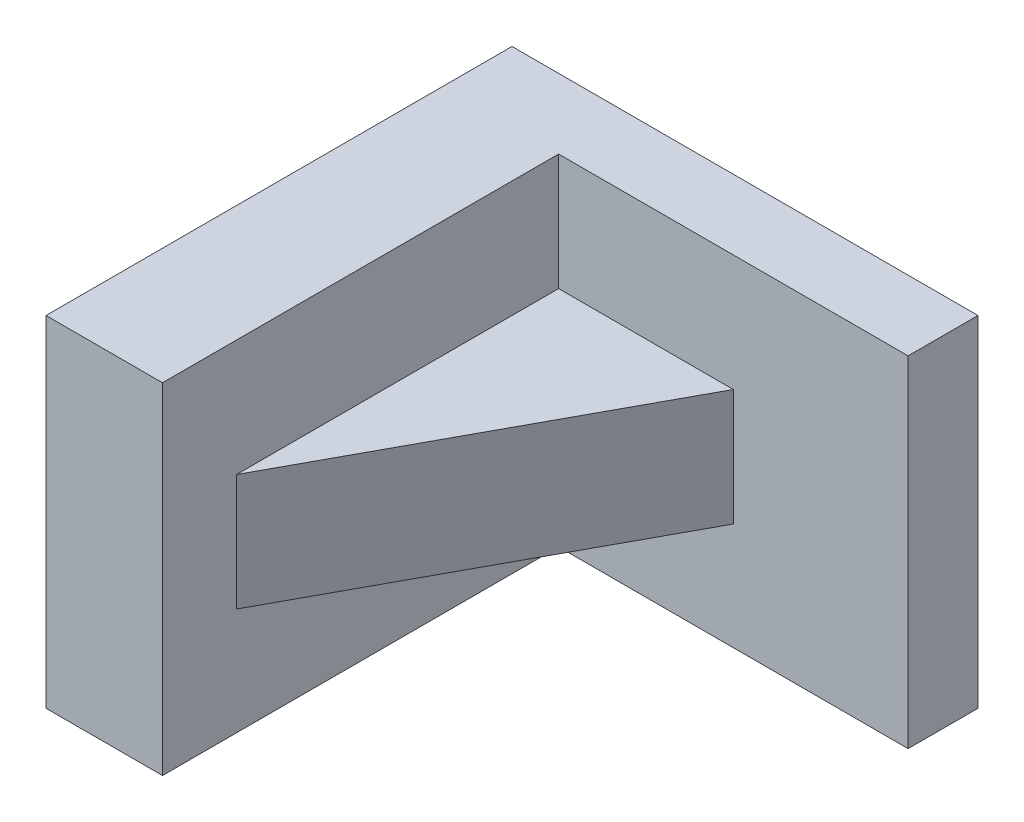
ISO-10303-21;
HEADER;
FILE_DESCRIPTION(('STEP AP214'),'2;1');
FILE_NAME('part.step','',(''),(''),'','','');
FILE_SCHEMA(('AUTOMOTIVE_DESIGN { 1 0 10303 214 1 1 1 1 }'));
ENDSEC;
DATA;
#1=APPLICATION_CONTEXT('core data for automotive mechanical design processes');
#2=APPLICATION_PROTOCOL_DEFINITION('international standard','automotive_design',2000,#1);
#3=PRODUCT_CONTEXT('',#1,'mechanical');
#4=PRODUCT('Part','Part','',(#3));
#5=PRODUCT_RELATED_PRODUCT_CATEGORY('part','',(#4));
#6=PRODUCT_DEFINITION_FORMATION('','',#4);
#7=PRODUCT_DEFINITION_CONTEXT('part definition',#1,'design');
#8=PRODUCT_DEFINITION('design','',#6,#7);
#9=PRODUCT_DEFINITION_SHAPE('','',#8);
#10=(LENGTH_UNIT() NAMED_UNIT(*) SI_UNIT(.MILLI.,.METRE.));
#11=(NAMED_UNIT(*) PLANE_ANGLE_UNIT() SI_UNIT($,.RADIAN.));
#12=(NAMED_UNIT(*) SI_UNIT($,.STERADIAN.) SOLID_ANGLE_UNIT());
#13=UNCERTAINTY_MEASURE_WITH_UNIT(LENGTH_MEASURE(1.E-05),#10,'distance_accuracy_value','');
#14=(GEOMETRIC_REPRESENTATION_CONTEXT(3) GLOBAL_UNCERTAINTY_ASSIGNED_CONTEXT((#13)) GLOBAL_UNIT_ASSIGNED_CONTEXT((#10,
#11,#12)) REPRESENTATION_CONTEXT('',''));
#15=CARTESIAN_POINT('',(0.,0.,0.));
#16=DIRECTION('',(0.,0.,1.));
#17=DIRECTION('',(1.,0.,0.));
#18=AXIS2_PLACEMENT_3D('',#15,#16,#17);
#19=CARTESIAN_POINT('',(-23.7846922204525,37.084,23.0562858632448));
#20=DIRECTION('',(-1.,0.,0.));
#21=DIRECTION('',(0.,0.,1.));
#22=AXIS2_PLACEMENT_3D('',#19,#20,#21);
#23=PLANE('',#22);
#24=DIRECTION('',(0.,0.,1.));
#25=VECTOR('',#24,1.);
#26=CARTESIAN_POINT('',(-23.7846922204525,24.384,-20.1237141367552));
#27=LINE('',#26,#25);
#28=CARTESIAN_POINT('',(-23.7846922204525,24.384,-20.1237141367552));
#29=VERTEX_POINT('',#28);
#30=CARTESIAN_POINT('',(-23.7846922204525,24.384,14.9820030777099));
#31=VERTEX_POINT('',#30);
#32=EDGE_CURVE('E167',#29,#31,#27,.T.);
#33=ORIENTED_EDGE('',*,*,#32,.F.);
#34=DIRECTION('',(0.,-1.,0.));
#35=VECTOR('',#34,1.);
#36=CARTESIAN_POINT('',(-23.7846922204525,37.084,-20.1237141367552));
#37=LINE('',#36,#35);
#38=CARTESIAN_POINT('',(-23.7846922204525,37.084,-20.1237141367552));
#39=VERTEX_POINT('',#38);
#40=EDGE_CURVE('E126',#39,#29,#37,.T.);
#41=ORIENTED_EDGE('',*,*,#40,.F.);
#42=DIRECTION('',(0.,0.,-1.));
#43=VECTOR('',#42,1.);
#44=CARTESIAN_POINT('',(-23.7846922204525,37.084,23.0562858632448));
#45=LINE('',#44,#43);
#46=CARTESIAN_POINT('',(-23.7846922204525,37.084,23.0562858632448));
#47=VERTEX_POINT('',#46);
#48=EDGE_CURVE('E109',#47,#39,#45,.T.);
#49=ORIENTED_EDGE('',*,*,#48,.F.);
#50=DIRECTION('',(0.,-1.,0.));
#51=VECTOR('',#50,1.);
#52=CARTESIAN_POINT('',(-23.7846922204525,37.084,23.0562858632448));
#53=LINE('',#52,#51);
#54=CARTESIAN_POINT('',(-23.7846922204525,0.,23.0562858632448));
#55=VERTEX_POINT('',#54);
#56=EDGE_CURVE('E118',#47,#55,#53,.T.);
#57=ORIENTED_EDGE('',*,*,#56,.T.);
#58=DIRECTION('',(0.,0.,-1.));
#59=VECTOR('',#58,1.);
#60=CARTESIAN_POINT('',(-23.7846922204525,0.,23.0562858632448));
#61=LINE('',#60,#59);
#62=CARTESIAN_POINT('',(-23.7846922204525,0.,-20.1237141367552));
#63=VERTEX_POINT('',#62);
#64=EDGE_CURVE('E144',#55,#63,#61,.T.);
#65=ORIENTED_EDGE('',*,*,#64,.T.);
#66=CARTESIAN_POINT('',(-23.7846922204525,11.684,-20.1237141367552));
#67=VERTEX_POINT('',#66);
#68=EDGE_CURVE('E149',#67,#63,#37,.T.);
#69=ORIENTED_EDGE('',*,*,#68,.F.);
#70=DIRECTION('',(0.,0.,1.));
#71=VECTOR('',#70,1.);
#72=CARTESIAN_POINT('',(-23.7846922204525,11.684,-20.1237141367552));
#73=LINE('',#72,#71);
#74=CARTESIAN_POINT('',(-23.7846922204525,11.684,14.9820030777099));
#75=VERTEX_POINT('',#74);
#76=EDGE_CURVE('E52',#67,#75,#73,.T.);
#77=ORIENTED_EDGE('',*,*,#76,.T.);
#78=DIRECTION('',(0.,-1.,0.));
#79=VECTOR('',#78,1.);
#80=CARTESIAN_POINT('',(-23.7846922204525,24.384,14.9820030777099));
#81=LINE('',#80,#79);
#82=EDGE_CURVE('E139',#31,#75,#81,.T.);
#83=ORIENTED_EDGE('',*,*,#82,.F.);
#84=EDGE_LOOP('',(#33,#41,#49,#57,#65,#69,#77,#83));
#85=FACE_BOUND('',#84,.T.);
#86=ADVANCED_FACE('F37',(#85),#23,.F.);
#87=CARTESIAN_POINT('',(-23.7846922204525,37.084,-20.1237141367552));
#88=DIRECTION('',(0.,0.,-1.));
#89=DIRECTION('',(-1.,0.,0.));
#90=AXIS2_PLACEMENT_3D('',#87,#88,#89);
#91=PLANE('',#90);
#92=DIRECTION('',(-1.,0.,0.));
#93=VECTOR('',#92,1.);
#94=CARTESIAN_POINT('',(-4.73469222045253,24.384,-20.1237141367552));
#95=LINE('',#94,#93);
#96=CARTESIAN_POINT('',(-4.73469222045253,24.384,-20.1237141367552));
#97=VERTEX_POINT('',#96);
#98=EDGE_CURVE('E178',#97,#29,#95,.T.);
#99=ORIENTED_EDGE('',*,*,#98,.F.);
#100=DIRECTION('',(0.,-1.,0.));
#101=VECTOR('',#100,1.);
#102=CARTESIAN_POINT('',(-4.73469222045253,24.384,-20.1237141367552));
#103=LINE('',#102,#101);
#104=CARTESIAN_POINT('',(-4.73469222045253,11.684,-20.1237141367552));
#105=VERTEX_POINT('',#104);
#106=EDGE_CURVE('E166',#97,#105,#103,.T.);
#107=ORIENTED_EDGE('',*,*,#106,.T.);
#108=DIRECTION('',(-1.,0.,0.));
#109=VECTOR('',#108,1.);
#110=CARTESIAN_POINT('',(-4.73469222045253,11.684,-20.1237141367552));
#111=LINE('',#110,#109);
#112=EDGE_CURVE('E164',#105,#67,#111,.T.);
#113=ORIENTED_EDGE('',*,*,#112,.T.);
#114=ORIENTED_EDGE('',*,*,#68,.T.);
#115=DIRECTION('',(1.,0.,0.));
#116=VECTOR('',#115,1.);
#117=CARTESIAN_POINT('',(-23.7846922204525,0.,-20.1237141367552));
#118=LINE('',#117,#116);
#119=CARTESIAN_POINT('',(14.3153077795475,0.,-20.1237141367552));
#120=VERTEX_POINT('',#119);
#121=EDGE_CURVE('E87',#63,#120,#118,.T.);
#122=ORIENTED_EDGE('',*,*,#121,.T.);
#123=DIRECTION('',(0.,-1.,0.));
#124=VECTOR('',#123,1.);
#125=CARTESIAN_POINT('',(14.3153077795475,37.084,-20.1237141367552));
#126=LINE('',#125,#124);
#127=CARTESIAN_POINT('',(14.3153077795475,37.084,-20.1237141367552));
#128=VERTEX_POINT('',#127);
#129=EDGE_CURVE('E131',#128,#120,#126,.T.);
#130=ORIENTED_EDGE('',*,*,#129,.F.);
#131=DIRECTION('',(1.,0.,0.));
#132=VECTOR('',#131,1.);
#133=CARTESIAN_POINT('',(-23.7846922204525,37.084,-20.1237141367552));
#134=LINE('',#133,#132);
#135=EDGE_CURVE('E61',#39,#128,#134,.T.);
#136=ORIENTED_EDGE('',*,*,#135,.F.);
#137=ORIENTED_EDGE('',*,*,#40,.T.);
#138=EDGE_LOOP('',(#99,#107,#113,#114,#122,#130,#136,#137));
#139=FACE_BOUND('',#138,.T.);
#140=ADVANCED_FACE('F162',(#139),#91,.F.);
#141=CARTESIAN_POINT('',(14.3153077795475,37.084,-20.1237141367552));
#142=DIRECTION('',(-1.,0.,0.));
#143=DIRECTION('',(0.,0.,1.));
#144=AXIS2_PLACEMENT_3D('',#141,#142,#143);
#145=PLANE('',#144);
#146=DIRECTION('',(0.,0.,-1.));
#147=VECTOR('',#146,1.);
#148=CARTESIAN_POINT('',(14.3153077795475,0.,-20.1237141367552));
#149=LINE('',#148,#147);
#150=CARTESIAN_POINT('',(14.3153077795475,0.,-27.7437141367552));
#151=VERTEX_POINT('',#150);
#152=EDGE_CURVE('E135',#120,#151,#149,.T.);
#153=ORIENTED_EDGE('',*,*,#152,.T.);
#154=DIRECTION('',(0.,-1.,0.));
#155=VECTOR('',#154,1.);
#156=CARTESIAN_POINT('',(14.3153077795475,37.084,-27.7437141367552));
#157=LINE('',#156,#155);
#158=CARTESIAN_POINT('',(14.3153077795475,37.084,-27.7437141367552));
#159=VERTEX_POINT('',#158);
#160=EDGE_CURVE('E11',#159,#151,#157,.T.);
#161=ORIENTED_EDGE('',*,*,#160,.F.);
#162=DIRECTION('',(0.,0.,-1.));
#163=VECTOR('',#162,1.);
#164=CARTESIAN_POINT('',(14.3153077795475,37.084,-20.1237141367552));
#165=LINE('',#164,#163);
#166=EDGE_CURVE('E147',#128,#159,#165,.T.);
#167=ORIENTED_EDGE('',*,*,#166,.F.);
#168=ORIENTED_EDGE('',*,*,#129,.T.);
#169=EDGE_LOOP('',(#153,#161,#167,#168));
#170=FACE_BOUND('',#169,.T.);
#171=ADVANCED_FACE('F39',(#170),#145,.F.);
#172=CARTESIAN_POINT('',(14.3153077795475,37.084,-27.7437141367552));
#173=DIRECTION('',(0.,0.,1.));
#174=DIRECTION('',(1.,0.,0.));
#175=AXIS2_PLACEMENT_3D('',#172,#173,#174);
#176=PLANE('',#175);
#177=DIRECTION('',(-1.,0.,0.));
#178=VECTOR('',#177,1.);
#179=CARTESIAN_POINT('',(14.3153077795475,0.,-27.7437141367552));
#180=LINE('',#179,#178);
#181=CARTESIAN_POINT('',(-36.4846922204525,0.,-27.7437141367552));
#182=VERTEX_POINT('',#181);
#183=EDGE_CURVE('E138',#151,#182,#180,.T.);
#184=ORIENTED_EDGE('',*,*,#183,.T.);
#185=DIRECTION('',(0.,-1.,0.));
#186=VECTOR('',#185,1.);
#187=CARTESIAN_POINT('',(-36.4846922204525,37.084,-27.7437141367552));
#188=LINE('',#187,#186);
#189=CARTESIAN_POINT('',(-36.4846922204525,37.084,-27.7437141367552));
#190=VERTEX_POINT('',#189);
#191=EDGE_CURVE('E45',#190,#182,#188,.T.);
#192=ORIENTED_EDGE('',*,*,#191,.F.);
#193=DIRECTION('',(-1.,0.,0.));
#194=VECTOR('',#193,1.);
#195=CARTESIAN_POINT('',(14.3153077795475,37.084,-27.7437141367552));
#196=LINE('',#195,#194);
#197=EDGE_CURVE('E95',#159,#190,#196,.T.);
#198=ORIENTED_EDGE('',*,*,#197,.F.);
#199=ORIENTED_EDGE('',*,*,#160,.T.);
#200=EDGE_LOOP('',(#184,#192,#198,#199));
#201=FACE_BOUND('',#200,.T.);
#202=ADVANCED_FACE('F185',(#201),#176,.F.);
#203=CARTESIAN_POINT('',(-36.4846922204525,37.084,-27.7437141367552));
#204=DIRECTION('',(1.,0.,0.));
#205=DIRECTION('',(0.,0.,-1.));
#206=AXIS2_PLACEMENT_3D('',#203,#204,#205);
#207=PLANE('',#206);
#208=DIRECTION('',(0.,0.,1.));
#209=VECTOR('',#208,1.);
#210=CARTESIAN_POINT('',(-36.4846922204525,0.,-27.7437141367552));
#211=LINE('',#210,#209);
#212=CARTESIAN_POINT('',(-36.4846922204525,0.,23.0562858632448));
#213=VERTEX_POINT('',#212);
#214=EDGE_CURVE('E141',#182,#213,#211,.T.);
#215=ORIENTED_EDGE('',*,*,#214,.T.);
#216=DIRECTION('',(0.,-1.,0.));
#217=VECTOR('',#216,1.);
#218=CARTESIAN_POINT('',(-36.4846922204525,37.084,23.0562858632448));
#219=LINE('',#218,#217);
#220=CARTESIAN_POINT('',(-36.4846922204525,37.084,23.0562858632448));
#221=VERTEX_POINT('',#220);
#222=EDGE_CURVE('E125',#221,#213,#219,.T.);
#223=ORIENTED_EDGE('',*,*,#222,.F.);
#224=DIRECTION('',(0.,0.,1.));
#225=VECTOR('',#224,1.);
#226=CARTESIAN_POINT('',(-36.4846922204525,37.084,-27.7437141367552));
#227=LINE('',#226,#225);
#228=EDGE_CURVE('E112',#190,#221,#227,.T.);
#229=ORIENTED_EDGE('',*,*,#228,.F.);
#230=ORIENTED_EDGE('',*,*,#191,.T.);
#231=EDGE_LOOP('',(#215,#223,#229,#230));
#232=FACE_BOUND('',#231,.T.);
#233=ADVANCED_FACE('F154',(#232),#207,.F.);
#234=CARTESIAN_POINT('',(-36.4846922204525,37.084,23.0562858632448));
#235=DIRECTION('',(0.,0.,-1.));
#236=DIRECTION('',(-1.,0.,0.));
#237=AXIS2_PLACEMENT_3D('',#234,#235,#236);
#238=PLANE('',#237);
#239=DIRECTION('',(1.,0.,0.));
#240=VECTOR('',#239,1.);
#241=CARTESIAN_POINT('',(-36.4846922204525,0.,23.0562858632448));
#242=LINE('',#241,#240);
#243=EDGE_CURVE('E121',#213,#55,#242,.T.);
#244=ORIENTED_EDGE('',*,*,#243,.T.);
#245=ORIENTED_EDGE('',*,*,#56,.F.);
#246=DIRECTION('',(1.,0.,0.));
#247=VECTOR('',#246,1.);
#248=CARTESIAN_POINT('',(-36.4846922204525,37.084,23.0562858632448));
#249=LINE('',#248,#247);
#250=EDGE_CURVE('E105',#221,#47,#249,.T.);
#251=ORIENTED_EDGE('',*,*,#250,.F.);
#252=ORIENTED_EDGE('',*,*,#222,.T.);
#253=EDGE_LOOP('',(#244,#245,#251,#252));
#254=FACE_BOUND('',#253,.T.);
#255=ADVANCED_FACE('F119',(#254),#238,.F.);
#256=CARTESIAN_POINT('',(0.,37.084,0.));
#257=DIRECTION('',(0.,1.,0.));
#258=DIRECTION('',(0.,0.,1.));
#259=AXIS2_PLACEMENT_3D('',#256,#257,#258);
#260=PLANE('',#259);
#261=ORIENTED_EDGE('',*,*,#166,.T.);
#262=ORIENTED_EDGE('',*,*,#197,.T.);
#263=ORIENTED_EDGE('',*,*,#228,.T.);
#264=ORIENTED_EDGE('',*,*,#250,.T.);
#265=ORIENTED_EDGE('',*,*,#48,.T.);
#266=ORIENTED_EDGE('',*,*,#135,.T.);
#267=EDGE_LOOP('',(#261,#262,#263,#264,#265,#266));
#268=FACE_BOUND('',#267,.T.);
#269=ADVANCED_FACE('F107',(#268),#260,.T.);
#270=CARTESIAN_POINT('',(0.,0.,0.));
#271=DIRECTION('',(0.,1.,0.));
#272=DIRECTION('',(0.,0.,1.));
#273=AXIS2_PLACEMENT_3D('',#270,#271,#272);
#274=PLANE('',#273);
#275=ORIENTED_EDGE('',*,*,#152,.F.);
#276=ORIENTED_EDGE('',*,*,#121,.F.);
#277=ORIENTED_EDGE('',*,*,#64,.F.);
#278=ORIENTED_EDGE('',*,*,#243,.F.);
#279=ORIENTED_EDGE('',*,*,#214,.F.);
#280=ORIENTED_EDGE('',*,*,#183,.F.);
#281=EDGE_LOOP('',(#275,#276,#277,#278,#279,#280));
#282=FACE_BOUND('',#281,.T.);
#283=ADVANCED_FACE('F157',(#282),#274,.F.);
#284=CARTESIAN_POINT('',(-23.7846922204525,24.384,14.9820030777099));
#285=DIRECTION('',(-0.878930991396085,0.,-0.476948962011131));
#286=DIRECTION('',(-0.476948962011131,0.,0.878930991396085));
#287=AXIS2_PLACEMENT_3D('',#284,#285,#286);
#288=PLANE('',#287);
#289=DIRECTION('',(0.476948962011131,0.,-0.878930991396085));
#290=VECTOR('',#289,1.);
#291=CARTESIAN_POINT('',(-23.7846922204525,11.684,14.9820030777099));
#292=LINE('',#291,#290);
#293=EDGE_CURVE('E168',#75,#105,#292,.T.);
#294=ORIENTED_EDGE('',*,*,#293,.T.);
#295=ORIENTED_EDGE('',*,*,#106,.F.);
#296=DIRECTION('',(0.476948962011131,0.,-0.878930991396085));
#297=VECTOR('',#296,1.);
#298=CARTESIAN_POINT('',(-23.7846922204525,24.384,14.9820030777099));
#299=LINE('',#298,#297);
#300=EDGE_CURVE('E171',#31,#97,#299,.T.);
#301=ORIENTED_EDGE('',*,*,#300,.F.);
#302=ORIENTED_EDGE('',*,*,#82,.T.);
#303=EDGE_LOOP('',(#294,#295,#301,#302));
#304=FACE_BOUND('',#303,.T.);
#305=ADVANCED_FACE('F208',(#304),#288,.F.);
#306=CARTESIAN_POINT('',(0.,24.384,0.));
#307=DIRECTION('',(0.,-1.,0.));
#308=DIRECTION('',(0.,0.,-1.));
#309=AXIS2_PLACEMENT_3D('',#306,#307,#308);
#310=PLANE('',#309);
#311=ORIENTED_EDGE('',*,*,#32,.T.);
#312=ORIENTED_EDGE('',*,*,#300,.T.);
#313=ORIENTED_EDGE('',*,*,#98,.T.);
#314=EDGE_LOOP('',(#311,#312,#313));
#315=FACE_BOUND('',#314,.T.);
#316=ADVANCED_FACE('F212',(#315),#310,.F.);
#317=CARTESIAN_POINT('',(0.,11.684,0.));
#318=DIRECTION('',(0.,-1.,0.));
#319=DIRECTION('',(0.,0.,-1.));
#320=AXIS2_PLACEMENT_3D('',#317,#318,#319);
#321=PLANE('',#320);
#322=ORIENTED_EDGE('',*,*,#76,.F.);
#323=ORIENTED_EDGE('',*,*,#112,.F.);
#324=ORIENTED_EDGE('',*,*,#293,.F.);
#325=EDGE_LOOP('',(#322,#323,#324));
#326=FACE_BOUND('',#325,.T.);
#327=ADVANCED_FACE('F214',(#326),#321,.T.);
#328=CLOSED_SHELL('',(#86,#140,#171,#202,#233,#255,#269,#283,#305,#316,#327));
#329=MANIFOLD_SOLID_BREP('B2',#328);
#330=ADVANCED_BREP_SHAPE_REPRESENTATION('',(#18,#329),#14);
#331=SHAPE_DEFINITION_REPRESENTATION(#9,#330);
ENDSEC;
END-ISO-10303-21;
